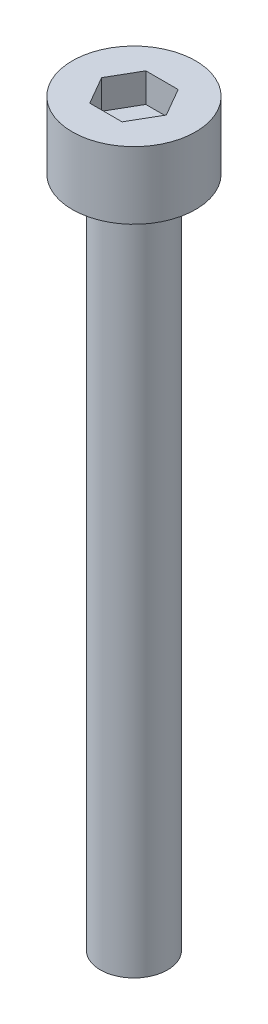
ISO-10303-21;
HEADER;
FILE_DESCRIPTION(('STEP AP214'),'2;1');
FILE_NAME('part.step','',(''),(''),'','','');
FILE_SCHEMA(('AUTOMOTIVE_DESIGN { 1 0 10303 214 1 1 1 1 }'));
ENDSEC;
DATA;
#1=APPLICATION_CONTEXT('core data for automotive mechanical design processes');
#2=APPLICATION_PROTOCOL_DEFINITION('international standard','automotive_design',2000,#1);
#3=PRODUCT_CONTEXT('',#1,'mechanical');
#4=PRODUCT('Part','Part','',(#3));
#5=PRODUCT_RELATED_PRODUCT_CATEGORY('part','',(#4));
#6=PRODUCT_DEFINITION_FORMATION('','',#4);
#7=PRODUCT_DEFINITION_CONTEXT('part definition',#1,'design');
#8=PRODUCT_DEFINITION('design','',#6,#7);
#9=PRODUCT_DEFINITION_SHAPE('','',#8);
#10=(LENGTH_UNIT() NAMED_UNIT(*) SI_UNIT(.MILLI.,.METRE.));
#11=(NAMED_UNIT(*) PLANE_ANGLE_UNIT() SI_UNIT($,.RADIAN.));
#12=(NAMED_UNIT(*) SI_UNIT($,.STERADIAN.) SOLID_ANGLE_UNIT());
#13=UNCERTAINTY_MEASURE_WITH_UNIT(LENGTH_MEASURE(1.E-05),#10,'distance_accuracy_value','');
#14=(GEOMETRIC_REPRESENTATION_CONTEXT(3) GLOBAL_UNCERTAINTY_ASSIGNED_CONTEXT((#13)) GLOBAL_UNIT_ASSIGNED_CONTEXT((#10,
#11,#12)) REPRESENTATION_CONTEXT('',''));
#15=CARTESIAN_POINT('',(0.,0.,0.));
#16=DIRECTION('',(0.,0.,1.));
#17=DIRECTION('',(1.,0.,0.));
#18=AXIS2_PLACEMENT_3D('',#15,#16,#17);
#19=CARTESIAN_POINT('',(0.,3.,0.));
#20=DIRECTION('',(0.,-1.,0.));
#21=DIRECTION('',(0.,0.,-1.));
#22=AXIS2_PLACEMENT_3D('',#19,#20,#21);
#23=CYLINDRICAL_SURFACE('',#22,2.75);
#24=CARTESIAN_POINT('',(0.,3.,0.));
#25=DIRECTION('',(0.,1.,0.));
#26=DIRECTION('',(0.,0.,1.));
#27=AXIS2_PLACEMENT_3D('',#24,#25,#26);
#28=CIRCLE('',#27,2.75);
#29=CARTESIAN_POINT('',(0.,3.,2.75));
#30=VERTEX_POINT('',#29);
#31=EDGE_CURVE('E45',#30,#30,#28,.T.);
#32=ORIENTED_EDGE('',*,*,#31,.F.);
#33=EDGE_LOOP('',(#32));
#34=FACE_BOUND('',#33,.T.);
#35=CARTESIAN_POINT('',(0.,0.,0.));
#36=DIRECTION('',(0.,1.,0.));
#37=DIRECTION('',(0.,0.,1.));
#38=AXIS2_PLACEMENT_3D('',#35,#36,#37);
#39=CIRCLE('',#38,2.75);
#40=CARTESIAN_POINT('',(0.,0.,2.75));
#41=VERTEX_POINT('',#40);
#42=EDGE_CURVE('E40',#41,#41,#39,.T.);
#43=ORIENTED_EDGE('',*,*,#42,.T.);
#44=EDGE_LOOP('',(#43));
#45=FACE_BOUND('',#44,.T.);
#46=ADVANCED_FACE('F37',(#34,#45),#23,.T.);
#47=CARTESIAN_POINT('',(0.,3.,0.));
#48=DIRECTION('',(0.,1.,0.));
#49=DIRECTION('',(0.,0.,1.));
#50=AXIS2_PLACEMENT_3D('',#47,#48,#49);
#51=PLANE('',#50);
#52=DIRECTION('',(0.5,0.,-0.866025403784439));
#53=VECTOR('',#52,1.);
#54=CARTESIAN_POINT('',(0.721687836487032,3.,1.25));
#55=LINE('',#54,#53);
#56=CARTESIAN_POINT('',(0.721687836487032,3.,1.25));
#57=VERTEX_POINT('',#56);
#58=CARTESIAN_POINT('',(1.44337567297406,3.,0.));
#59=VERTEX_POINT('',#58);
#60=EDGE_CURVE('E53',#57,#59,#55,.T.);
#61=ORIENTED_EDGE('',*,*,#60,.F.);
#62=DIRECTION('',(1.,0.,0.));
#63=VECTOR('',#62,1.);
#64=CARTESIAN_POINT('',(-0.721687836487033,3.,1.25));
#65=LINE('',#64,#63);
#66=CARTESIAN_POINT('',(-0.721687836487033,3.,1.25));
#67=VERTEX_POINT('',#66);
#68=EDGE_CURVE('E137',#67,#57,#65,.T.);
#69=ORIENTED_EDGE('',*,*,#68,.F.);
#70=DIRECTION('',(0.5,0.,0.866025403784439));
#71=VECTOR('',#70,1.);
#72=CARTESIAN_POINT('',(-1.44337567297407,3.,0.));
#73=LINE('',#72,#71);
#74=CARTESIAN_POINT('',(-1.44337567297407,3.,0.));
#75=VERTEX_POINT('',#74);
#76=EDGE_CURVE('E135',#75,#67,#73,.T.);
#77=ORIENTED_EDGE('',*,*,#76,.F.);
#78=DIRECTION('',(-0.5,0.,0.866025403784438));
#79=VECTOR('',#78,1.);
#80=CARTESIAN_POINT('',(-0.721687836487033,3.,-1.25));
#81=LINE('',#80,#79);
#82=CARTESIAN_POINT('',(-0.721687836487033,3.,-1.25));
#83=VERTEX_POINT('',#82);
#84=EDGE_CURVE('E101',#83,#75,#81,.T.);
#85=ORIENTED_EDGE('',*,*,#84,.F.);
#86=DIRECTION('',(-1.,0.,0.));
#87=VECTOR('',#86,1.);
#88=CARTESIAN_POINT('',(0.721687836487032,3.,-1.25));
#89=LINE('',#88,#87);
#90=CARTESIAN_POINT('',(0.721687836487032,3.,-1.25));
#91=VERTEX_POINT('',#90);
#92=EDGE_CURVE('E131',#91,#83,#89,.T.);
#93=ORIENTED_EDGE('',*,*,#92,.F.);
#94=DIRECTION('',(-0.5,0.,-0.866025403784439));
#95=VECTOR('',#94,1.);
#96=CARTESIAN_POINT('',(1.44337567297406,3.,0.));
#97=LINE('',#96,#95);
#98=EDGE_CURVE('E127',#59,#91,#97,.T.);
#99=ORIENTED_EDGE('',*,*,#98,.F.);
#100=EDGE_LOOP('',(#61,#69,#77,#85,#93,#99));
#101=FACE_BOUND('',#100,.T.);
#102=ORIENTED_EDGE('',*,*,#31,.T.);
#103=EDGE_LOOP('',(#102));
#104=FACE_BOUND('',#103,.T.);
#105=ADVANCED_FACE('F155',(#101,#104),#51,.T.);
#106=CARTESIAN_POINT('',(0.,0.,0.));
#107=DIRECTION('',(0.,1.,0.));
#108=DIRECTION('',(0.,0.,1.));
#109=AXIS2_PLACEMENT_3D('',#106,#107,#108);
#110=PLANE('',#109);
#111=CARTESIAN_POINT('',(0.,0.,0.));
#112=DIRECTION('',(0.,-1.,0.));
#113=DIRECTION('',(0.,0.,-1.));
#114=AXIS2_PLACEMENT_3D('',#111,#112,#113);
#115=CIRCLE('',#114,1.5);
#116=CARTESIAN_POINT('',(0.,0.,-1.5));
#117=VERTEX_POINT('',#116);
#118=EDGE_CURVE('E11',#117,#117,#115,.T.);
#119=ORIENTED_EDGE('',*,*,#118,.F.);
#120=EDGE_LOOP('',(#119));
#121=FACE_BOUND('',#120,.T.);
#122=ORIENTED_EDGE('',*,*,#42,.F.);
#123=EDGE_LOOP('',(#122));
#124=FACE_BOUND('',#123,.T.);
#125=ADVANCED_FACE('F152',(#121,#124),#110,.F.);
#126=CARTESIAN_POINT('',(0.721687836487032,1.7,1.25));
#127=DIRECTION('',(0.866025403784439,0.,0.5));
#128=DIRECTION('',(0.5,0.,-0.866025403784439));
#129=AXIS2_PLACEMENT_3D('',#126,#127,#128);
#130=PLANE('',#129);
#131=ORIENTED_EDGE('',*,*,#60,.T.);
#132=DIRECTION('',(0.,1.,0.));
#133=VECTOR('',#132,1.);
#134=CARTESIAN_POINT('',(1.44337567297406,1.7,0.));
#135=LINE('',#134,#133);
#136=CARTESIAN_POINT('',(1.44337567297406,1.7,0.));
#137=VERTEX_POINT('',#136);
#138=EDGE_CURVE('E83',#137,#59,#135,.T.);
#139=ORIENTED_EDGE('',*,*,#138,.F.);
#140=DIRECTION('',(0.5,0.,-0.866025403784439));
#141=VECTOR('',#140,1.);
#142=CARTESIAN_POINT('',(0.721687836487032,1.7,1.25));
#143=LINE('',#142,#141);
#144=CARTESIAN_POINT('',(0.721687836487032,1.7,1.25));
#145=VERTEX_POINT('',#144);
#146=EDGE_CURVE('E139',#145,#137,#143,.T.);
#147=ORIENTED_EDGE('',*,*,#146,.F.);
#148=DIRECTION('',(0.,1.,0.));
#149=VECTOR('',#148,1.);
#150=CARTESIAN_POINT('',(0.721687836487032,1.7,1.25));
#151=LINE('',#150,#149);
#152=EDGE_CURVE('E61',#145,#57,#151,.T.);
#153=ORIENTED_EDGE('',*,*,#152,.T.);
#154=EDGE_LOOP('',(#131,#139,#147,#153));
#155=FACE_BOUND('',#154,.T.);
#156=ADVANCED_FACE('F154',(#155),#130,.F.);
#157=CARTESIAN_POINT('',(-0.721687836487033,1.7,1.25));
#158=DIRECTION('',(0.,0.,1.));
#159=DIRECTION('',(1.,0.,0.));
#160=AXIS2_PLACEMENT_3D('',#157,#158,#159);
#161=PLANE('',#160);
#162=ORIENTED_EDGE('',*,*,#68,.T.);
#163=ORIENTED_EDGE('',*,*,#152,.F.);
#164=DIRECTION('',(1.,0.,0.));
#165=VECTOR('',#164,1.);
#166=CARTESIAN_POINT('',(-0.721687836487033,1.7,1.25));
#167=LINE('',#166,#165);
#168=CARTESIAN_POINT('',(-0.721687836487033,1.7,1.25));
#169=VERTEX_POINT('',#168);
#170=EDGE_CURVE('E113',#169,#145,#167,.T.);
#171=ORIENTED_EDGE('',*,*,#170,.F.);
#172=DIRECTION('',(0.,1.,0.));
#173=VECTOR('',#172,1.);
#174=CARTESIAN_POINT('',(-0.721687836487033,1.7,1.25));
#175=LINE('',#174,#173);
#176=EDGE_CURVE('E105',#169,#67,#175,.T.);
#177=ORIENTED_EDGE('',*,*,#176,.T.);
#178=EDGE_LOOP('',(#162,#163,#171,#177));
#179=FACE_BOUND('',#178,.T.);
#180=ADVANCED_FACE('F161',(#179),#161,.F.);
#181=CARTESIAN_POINT('',(-1.44337567297407,1.7,0.));
#182=DIRECTION('',(-0.866025403784439,0.,0.5));
#183=DIRECTION('',(0.5,0.,0.866025403784439));
#184=AXIS2_PLACEMENT_3D('',#181,#182,#183);
#185=PLANE('',#184);
#186=ORIENTED_EDGE('',*,*,#76,.T.);
#187=ORIENTED_EDGE('',*,*,#176,.F.);
#188=DIRECTION('',(0.5,0.,0.866025403784439));
#189=VECTOR('',#188,1.);
#190=CARTESIAN_POINT('',(-1.44337567297407,1.7,0.));
#191=LINE('',#190,#189);
#192=CARTESIAN_POINT('',(-1.44337567297407,1.7,0.));
#193=VERTEX_POINT('',#192);
#194=EDGE_CURVE('E109',#193,#169,#191,.T.);
#195=ORIENTED_EDGE('',*,*,#194,.F.);
#196=DIRECTION('',(0.,1.,0.));
#197=VECTOR('',#196,1.);
#198=CARTESIAN_POINT('',(-1.44337567297407,1.7,0.));
#199=LINE('',#198,#197);
#200=EDGE_CURVE('E94',#193,#75,#199,.T.);
#201=ORIENTED_EDGE('',*,*,#200,.T.);
#202=EDGE_LOOP('',(#186,#187,#195,#201));
#203=FACE_BOUND('',#202,.T.);
#204=ADVANCED_FACE('F110',(#203),#185,.F.);
#205=CARTESIAN_POINT('',(-0.721687836487033,1.7,-1.25));
#206=DIRECTION('',(-0.866025403784439,0.,-0.5));
#207=DIRECTION('',(-0.5,0.,0.866025403784439));
#208=AXIS2_PLACEMENT_3D('',#205,#206,#207);
#209=PLANE('',#208);
#210=ORIENTED_EDGE('',*,*,#84,.T.);
#211=ORIENTED_EDGE('',*,*,#200,.F.);
#212=DIRECTION('',(-0.5,0.,0.866025403784438));
#213=VECTOR('',#212,1.);
#214=CARTESIAN_POINT('',(-0.721687836487033,1.7,-1.25));
#215=LINE('',#214,#213);
#216=CARTESIAN_POINT('',(-0.721687836487033,1.7,-1.25));
#217=VERTEX_POINT('',#216);
#218=EDGE_CURVE('E98',#217,#193,#215,.T.);
#219=ORIENTED_EDGE('',*,*,#218,.F.);
#220=DIRECTION('',(0.,1.,0.));
#221=VECTOR('',#220,1.);
#222=CARTESIAN_POINT('',(-0.721687836487033,1.7,-1.25));
#223=LINE('',#222,#221);
#224=EDGE_CURVE('E106',#217,#83,#223,.T.);
#225=ORIENTED_EDGE('',*,*,#224,.T.);
#226=EDGE_LOOP('',(#210,#211,#219,#225));
#227=FACE_BOUND('',#226,.T.);
#228=ADVANCED_FACE('F96',(#227),#209,.F.);
#229=CARTESIAN_POINT('',(0.721687836487032,1.7,-1.25));
#230=DIRECTION('',(0.,0.,-1.));
#231=DIRECTION('',(-1.,0.,0.));
#232=AXIS2_PLACEMENT_3D('',#229,#230,#231);
#233=PLANE('',#232);
#234=ORIENTED_EDGE('',*,*,#92,.T.);
#235=ORIENTED_EDGE('',*,*,#224,.F.);
#236=DIRECTION('',(-1.,0.,0.));
#237=VECTOR('',#236,1.);
#238=CARTESIAN_POINT('',(0.721687836487032,1.7,-1.25));
#239=LINE('',#238,#237);
#240=CARTESIAN_POINT('',(0.721687836487032,1.7,-1.25));
#241=VERTEX_POINT('',#240);
#242=EDGE_CURVE('E119',#241,#217,#239,.T.);
#243=ORIENTED_EDGE('',*,*,#242,.F.);
#244=DIRECTION('',(0.,1.,0.));
#245=VECTOR('',#244,1.);
#246=CARTESIAN_POINT('',(0.721687836487032,1.7,-1.25));
#247=LINE('',#246,#245);
#248=EDGE_CURVE('E143',#241,#91,#247,.T.);
#249=ORIENTED_EDGE('',*,*,#248,.T.);
#250=EDGE_LOOP('',(#234,#235,#243,#249));
#251=FACE_BOUND('',#250,.T.);
#252=ADVANCED_FACE('F206',(#251),#233,.F.);
#253=CARTESIAN_POINT('',(1.44337567297406,1.7,0.));
#254=DIRECTION('',(0.866025403784439,0.,-0.5));
#255=DIRECTION('',(-0.5,0.,-0.866025403784439));
#256=AXIS2_PLACEMENT_3D('',#253,#254,#255);
#257=PLANE('',#256);
#258=ORIENTED_EDGE('',*,*,#98,.T.);
#259=ORIENTED_EDGE('',*,*,#248,.F.);
#260=DIRECTION('',(-0.5,0.,-0.866025403784439));
#261=VECTOR('',#260,1.);
#262=CARTESIAN_POINT('',(1.44337567297406,1.7,0.));
#263=LINE('',#262,#261);
#264=EDGE_CURVE('E121',#137,#241,#263,.T.);
#265=ORIENTED_EDGE('',*,*,#264,.F.);
#266=ORIENTED_EDGE('',*,*,#138,.T.);
#267=EDGE_LOOP('',(#258,#259,#265,#266));
#268=FACE_BOUND('',#267,.T.);
#269=ADVANCED_FACE('F215',(#268),#257,.F.);
#270=CARTESIAN_POINT('',(0.,1.7,0.));
#271=DIRECTION('',(0.,1.,0.));
#272=DIRECTION('',(0.,0.,1.));
#273=AXIS2_PLACEMENT_3D('',#270,#271,#272);
#274=PLANE('',#273);
#275=ORIENTED_EDGE('',*,*,#146,.T.);
#276=ORIENTED_EDGE('',*,*,#264,.T.);
#277=ORIENTED_EDGE('',*,*,#242,.T.);
#278=ORIENTED_EDGE('',*,*,#218,.T.);
#279=ORIENTED_EDGE('',*,*,#194,.T.);
#280=ORIENTED_EDGE('',*,*,#170,.T.);
#281=EDGE_LOOP('',(#275,#276,#277,#278,#279,#280));
#282=FACE_BOUND('',#281,.T.);
#283=ADVANCED_FACE('F116',(#282),#274,.T.);
#284=CARTESIAN_POINT('',(0.,-30.,0.));
#285=DIRECTION('',(0.,1.,0.));
#286=DIRECTION('',(0.,0.,1.));
#287=AXIS2_PLACEMENT_3D('',#284,#285,#286);
#288=CYLINDRICAL_SURFACE('',#287,1.5);
#289=CARTESIAN_POINT('',(0.,-30.,0.));
#290=DIRECTION('',(0.,-1.,0.));
#291=DIRECTION('',(0.,0.,-1.));
#292=AXIS2_PLACEMENT_3D('',#289,#290,#291);
#293=CIRCLE('',#292,1.5);
#294=CARTESIAN_POINT('',(0.,-30.,-1.5));
#295=VERTEX_POINT('',#294);
#296=EDGE_CURVE('E128',#295,#295,#293,.T.);
#297=ORIENTED_EDGE('',*,*,#296,.F.);
#298=EDGE_LOOP('',(#297));
#299=FACE_BOUND('',#298,.T.);
#300=ORIENTED_EDGE('',*,*,#118,.T.);
#301=EDGE_LOOP('',(#300));
#302=FACE_BOUND('',#301,.T.);
#303=ADVANCED_FACE('F233',(#299,#302),#288,.T.);
#304=CARTESIAN_POINT('',(0.,-30.,0.));
#305=DIRECTION('',(0.,-1.,0.));
#306=DIRECTION('',(0.,0.,-1.));
#307=AXIS2_PLACEMENT_3D('',#304,#305,#306);
#308=PLANE('',#307);
#309=ORIENTED_EDGE('',*,*,#296,.T.);
#310=EDGE_LOOP('',(#309));
#311=FACE_BOUND('',#310,.T.);
#312=ADVANCED_FACE('F247',(#311),#308,.T.);
#313=CLOSED_SHELL('',(#46,#105,#125,#156,#180,#204,#228,#252,#269,#283,#303,#312));
#314=MANIFOLD_SOLID_BREP('B2',#313);
#315=ADVANCED_BREP_SHAPE_REPRESENTATION('',(#18,#314),#14);
#316=SHAPE_DEFINITION_REPRESENTATION(#9,#315);
ENDSEC;
END-ISO-10303-21;
